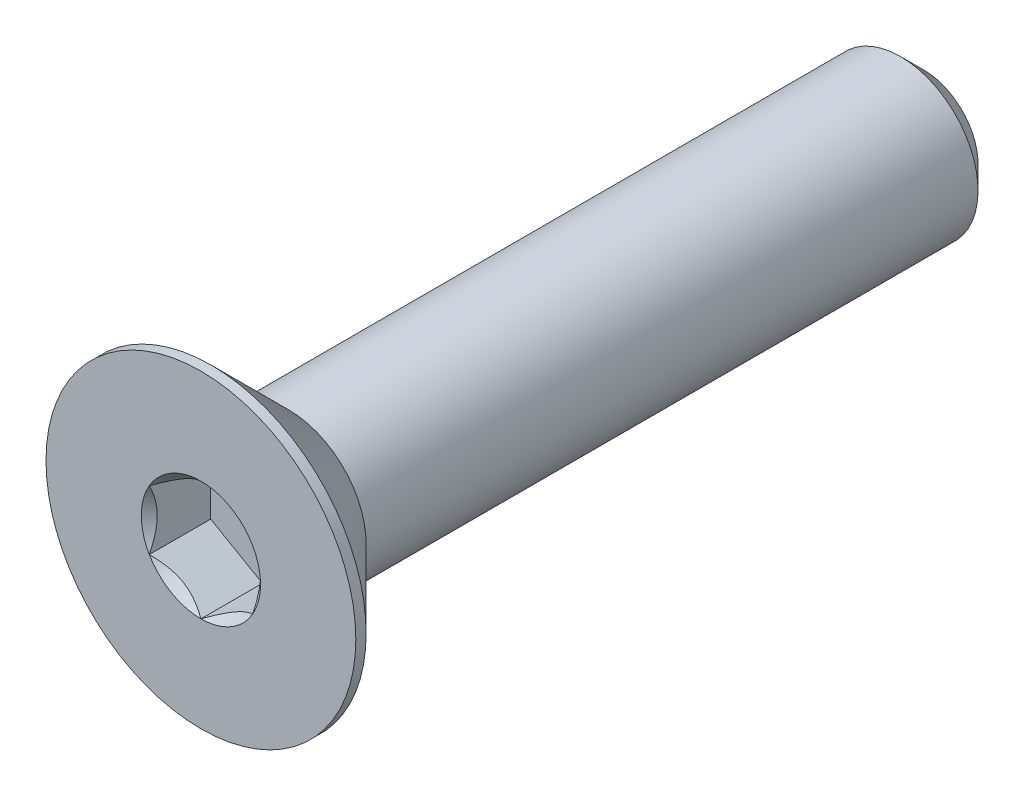
ISO-10303-21;
HEADER;
FILE_DESCRIPTION(('STEP AP214'),'2;1');
FILE_NAME('part.step','',(''),(''),'','','');
FILE_SCHEMA(('AUTOMOTIVE_DESIGN { 1 0 10303 214 1 1 1 1 }'));
ENDSEC;
DATA;
#1=APPLICATION_CONTEXT('core data for automotive mechanical design processes');
#2=APPLICATION_PROTOCOL_DEFINITION('international standard','automotive_design',2000,#1);
#3=PRODUCT_CONTEXT('',#1,'mechanical');
#4=PRODUCT('Part','Part','',(#3));
#5=PRODUCT_RELATED_PRODUCT_CATEGORY('part','',(#4));
#6=PRODUCT_DEFINITION_FORMATION('','',#4);
#7=PRODUCT_DEFINITION_CONTEXT('part definition',#1,'design');
#8=PRODUCT_DEFINITION('design','',#6,#7);
#9=PRODUCT_DEFINITION_SHAPE('','',#8);
#10=(LENGTH_UNIT() NAMED_UNIT(*) SI_UNIT(.MILLI.,.METRE.));
#11=(NAMED_UNIT(*) PLANE_ANGLE_UNIT() SI_UNIT($,.RADIAN.));
#12=(NAMED_UNIT(*) SI_UNIT($,.STERADIAN.) SOLID_ANGLE_UNIT());
#13=UNCERTAINTY_MEASURE_WITH_UNIT(LENGTH_MEASURE(1.E-05),#10,'distance_accuracy_value','');
#14=(GEOMETRIC_REPRESENTATION_CONTEXT(3) GLOBAL_UNCERTAINTY_ASSIGNED_CONTEXT((#13)) GLOBAL_UNIT_ASSIGNED_CONTEXT((#10,
#11,#12)) REPRESENTATION_CONTEXT('',''));
#15=CARTESIAN_POINT('',(0.,0.,0.));
#16=DIRECTION('',(0.,0.,1.));
#17=DIRECTION('',(1.,0.,0.));
#18=AXIS2_PLACEMENT_3D('',#15,#16,#17);
#19=CARTESIAN_POINT('',(0.,0.,-7.));
#20=DIRECTION('',(0.,0.,-1.));
#21=DIRECTION('',(0.,1.,0.));
#22=AXIS2_PLACEMENT_3D('',#19,#20,#21);
#23=CYLINDRICAL_SURFACE('',#22,1.5);
#24=CARTESIAN_POINT('',(0.,0.,5.3));
#25=DIRECTION('',(0.,0.,-1.));
#26=DIRECTION('',(0.,1.,0.));
#27=AXIS2_PLACEMENT_3D('',#24,#25,#26);
#28=CIRCLE('',#27,1.5);
#29=CARTESIAN_POINT('',(0.,1.5,5.3));
#30=VERTEX_POINT('',#29);
#31=EDGE_CURVE('E11',#30,#30,#28,.F.);
#32=ORIENTED_EDGE('',*,*,#31,.F.);
#33=EDGE_LOOP('',(#32));
#34=FACE_BOUND('',#33,.T.);
#35=CARTESIAN_POINT('',(0.,0.,-6.55));
#36=DIRECTION('',(0.,0.,-1.));
#37=DIRECTION('',(0.,1.,0.));
#38=AXIS2_PLACEMENT_3D('',#35,#36,#37);
#39=CIRCLE('',#38,1.5);
#40=CARTESIAN_POINT('',(0.,1.5,-6.55));
#41=VERTEX_POINT('',#40);
#42=EDGE_CURVE('E50',#41,#41,#39,.F.);
#43=ORIENTED_EDGE('',*,*,#42,.T.);
#44=EDGE_LOOP('',(#43));
#45=FACE_BOUND('',#44,.T.);
#46=ADVANCED_FACE('F41',(#34,#45),#23,.T.);
#47=CARTESIAN_POINT('',(0.,1.5,-7.));
#48=DIRECTION('',(0.,0.,-1.));
#49=DIRECTION('',(0.,1.,0.));
#50=AXIS2_PLACEMENT_3D('',#47,#48,#49);
#51=PLANE('',#50);
#52=CARTESIAN_POINT('',(0.,0.,-7.));
#53=DIRECTION('',(0.,0.,-1.));
#54=DIRECTION('',(0.,1.,0.));
#55=AXIS2_PLACEMENT_3D('',#52,#53,#54);
#56=CIRCLE('',#55,1.05);
#57=CARTESIAN_POINT('',(0.,1.05,-7.));
#58=VERTEX_POINT('',#57);
#59=EDGE_CURVE('E166',#58,#58,#56,.T.);
#60=ORIENTED_EDGE('',*,*,#59,.T.);
#61=EDGE_LOOP('',(#60));
#62=FACE_BOUND('',#61,.T.);
#63=ADVANCED_FACE('F177',(#62),#51,.T.);
#64=CARTESIAN_POINT('',(0.,0.,-7.));
#65=DIRECTION('',(0.,0.,1.));
#66=DIRECTION('',(0.,-1.,0.));
#67=AXIS2_PLACEMENT_3D('',#64,#65,#66);
#68=CONICAL_SURFACE('',#67,1.05,0.785398163397447);
#69=ORIENTED_EDGE('',*,*,#42,.F.);
#70=EDGE_LOOP('',(#69));
#71=FACE_BOUND('',#70,.T.);
#72=ORIENTED_EDGE('',*,*,#59,.F.);
#73=EDGE_LOOP('',(#72));
#74=FACE_BOUND('',#73,.T.);
#75=ADVANCED_FACE('F43',(#71,#74),#68,.T.);
#76=CARTESIAN_POINT('',(0.,0.,-7.));
#77=DIRECTION('',(0.,0.,-1.));
#78=DIRECTION('',(0.,1.,0.));
#79=AXIS2_PLACEMENT_3D('',#76,#77,#78);
#80=CYLINDRICAL_SURFACE('',#79,3.);
#81=CARTESIAN_POINT('',(0.,0.,7.));
#82=DIRECTION('',(0.,0.,-1.));
#83=DIRECTION('',(0.,1.,0.));
#84=AXIS2_PLACEMENT_3D('',#81,#82,#83);
#85=CIRCLE('',#84,3.);
#86=CARTESIAN_POINT('',(0.,3.,7.));
#87=VERTEX_POINT('',#86);
#88=EDGE_CURVE('E141',#87,#87,#85,.T.);
#89=ORIENTED_EDGE('',*,*,#88,.T.);
#90=EDGE_LOOP('',(#89));
#91=FACE_BOUND('',#90,.T.);
#92=CARTESIAN_POINT('',(0.,0.,6.8));
#93=DIRECTION('',(0.,0.,-1.));
#94=DIRECTION('',(0.,1.,0.));
#95=AXIS2_PLACEMENT_3D('',#92,#93,#94);
#96=CIRCLE('',#95,3.);
#97=CARTESIAN_POINT('',(0.,3.,6.8));
#98=VERTEX_POINT('',#97);
#99=EDGE_CURVE('E136',#98,#98,#96,.T.);
#100=ORIENTED_EDGE('',*,*,#99,.F.);
#101=EDGE_LOOP('',(#100));
#102=FACE_BOUND('',#101,.T.);
#103=ADVANCED_FACE('F176',(#91,#102),#80,.T.);
#104=CARTESIAN_POINT('',(0.,0.,5.3));
#105=DIRECTION('',(0.,0.,1.));
#106=DIRECTION('',(0.,-1.,0.));
#107=AXIS2_PLACEMENT_3D('',#104,#105,#106);
#108=CONICAL_SURFACE('',#107,1.5,0.785398163397449);
#109=ORIENTED_EDGE('',*,*,#99,.T.);
#110=EDGE_LOOP('',(#109));
#111=FACE_BOUND('',#110,.T.);
#112=ORIENTED_EDGE('',*,*,#31,.T.);
#113=EDGE_LOOP('',(#112));
#114=FACE_BOUND('',#113,.T.);
#115=ADVANCED_FACE('F190',(#111,#114),#108,.T.);
#116=CARTESIAN_POINT('',(0.,0.,7.));
#117=DIRECTION('',(0.,0.,1.));
#118=DIRECTION('',(0.,-1.,0.));
#119=AXIS2_PLACEMENT_3D('',#116,#117,#118);
#120=PLANE('',#119);
#121=CARTESIAN_POINT('',(0.,0.,7.));
#122=DIRECTION('',(0.,0.,1.));
#123=DIRECTION('',(1.,0.,0.));
#124=AXIS2_PLACEMENT_3D('',#121,#122,#123);
#125=CIRCLE('',#124,1.15470053837925);
#126=CARTESIAN_POINT('',(1.,0.577350269189633,7.));
#127=VERTEX_POINT('',#126);
#128=CARTESIAN_POINT('',(0.,1.15470053837926,7.));
#129=VERTEX_POINT('',#128);
#130=EDGE_CURVE('E101',#127,#129,#125,.T.);
#131=ORIENTED_EDGE('',*,*,#130,.F.);
#132=CARTESIAN_POINT('',(0.,0.,7.));
#133=DIRECTION('',(0.,0.,1.));
#134=DIRECTION('',(1.,0.,0.));
#135=AXIS2_PLACEMENT_3D('',#132,#133,#134);
#136=CIRCLE('',#135,1.15470053837925);
#137=CARTESIAN_POINT('',(0.999999999999991,-0.577350269189631,7.));
#138=VERTEX_POINT('',#137);
#139=EDGE_CURVE('E114',#138,#127,#136,.T.);
#140=ORIENTED_EDGE('',*,*,#139,.F.);
#141=CARTESIAN_POINT('',(0.,0.,7.));
#142=DIRECTION('',(0.,0.,1.));
#143=DIRECTION('',(1.,0.,0.));
#144=AXIS2_PLACEMENT_3D('',#141,#142,#143);
#145=CIRCLE('',#144,1.15470053837925);
#146=CARTESIAN_POINT('',(0.,-1.15470053837924,7.));
#147=VERTEX_POINT('',#146);
#148=EDGE_CURVE('E270',#147,#138,#145,.T.);
#149=ORIENTED_EDGE('',*,*,#148,.F.);
#150=CARTESIAN_POINT('',(0.,0.,7.));
#151=DIRECTION('',(0.,0.,1.));
#152=DIRECTION('',(1.,0.,0.));
#153=AXIS2_PLACEMENT_3D('',#150,#151,#152);
#154=CIRCLE('',#153,1.15470053837925);
#155=CARTESIAN_POINT('',(-1.,-0.577350269189616,7.));
#156=VERTEX_POINT('',#155);
#157=EDGE_CURVE('E130',#156,#147,#154,.T.);
#158=ORIENTED_EDGE('',*,*,#157,.F.);
#159=CARTESIAN_POINT('',(0.,0.,7.));
#160=DIRECTION('',(0.,0.,1.));
#161=DIRECTION('',(1.,0.,0.));
#162=AXIS2_PLACEMENT_3D('',#159,#160,#161);
#163=CIRCLE('',#162,1.15470053837925);
#164=CARTESIAN_POINT('',(-1.00000000000001,0.577350269189623,7.));
#165=VERTEX_POINT('',#164);
#166=EDGE_CURVE('E271',#165,#156,#163,.T.);
#167=ORIENTED_EDGE('',*,*,#166,.F.);
#168=CARTESIAN_POINT('',(0.,0.,7.));
#169=DIRECTION('',(0.,0.,1.));
#170=DIRECTION('',(1.,0.,0.));
#171=AXIS2_PLACEMENT_3D('',#168,#169,#170);
#172=CIRCLE('',#171,1.15470053837925);
#173=EDGE_CURVE('E117',#129,#165,#172,.T.);
#174=ORIENTED_EDGE('',*,*,#173,.F.);
#175=EDGE_LOOP('',(#131,#140,#149,#158,#167,#174));
#176=FACE_BOUND('',#175,.T.);
#177=ORIENTED_EDGE('',*,*,#88,.F.);
#178=EDGE_LOOP('',(#177));
#179=FACE_BOUND('',#178,.T.);
#180=ADVANCED_FACE('F111',(#176,#179),#120,.T.);
#181=CARTESIAN_POINT('',(1.,0.577350269189626,5.81));
#182=DIRECTION('',(0.5,0.866025403784438,0.));
#183=DIRECTION('',(-0.866025403784439,0.5,0.));
#184=AXIS2_PLACEMENT_3D('',#181,#182,#183);
#185=PLANE('',#184);
#186=DIRECTION('',(0.,0.,1.));
#187=VECTOR('',#186,1.);
#188=CARTESIAN_POINT('',(1.,0.577350269189626,5.81));
#189=LINE('',#188,#187);
#190=CARTESIAN_POINT('',(1.,0.577350269189626,5.81));
#191=VERTEX_POINT('',#190);
#192=EDGE_CURVE('E57',#191,#127,#189,.T.);
#193=ORIENTED_EDGE('',*,*,#192,.T.);
#194=CARTESIAN_POINT('',(-0.00019999999999976,1.15481600843309,7.00011548737261));
#195=CARTESIAN_POINT('',(0.0341825950071804,1.13496520795026,6.98027793082573));
#196=CARTESIAN_POINT('',(0.0691401181398243,1.11478247255942,6.96160502063888));
#197=CARTESIAN_POINT('',(0.140422802956089,1.07362739529219,6.92741474272315));
#198=CARTESIAN_POINT('',(0.176754750528983,1.0526511355808,6.91191640902345));
#199=CARTESIAN_POINT('',(0.25001661380331,1.01035337909803,6.88536730714226));
#200=CARTESIAN_POINT('',(0.286927851445413,0.989042666109242,6.87424977399692));
#201=CARTESIAN_POINT('',(0.361562729310857,0.945952199282693,6.85711986577618));
#202=CARTESIAN_POINT('',(0.399284088108634,0.924173762626598,6.85109469746667));
#203=CARTESIAN_POINT('',(0.464292198417931,0.886641312640016,6.84566055496749));
#204=CARTESIAN_POINT('',(0.491494371528169,0.870936130672277,6.84485693831673));
#205=CARTESIAN_POINT('',(0.545846040669109,0.83955617986285,6.84620669941688));
#206=CARTESIAN_POINT('',(0.572995523754872,0.823881418494926,6.84836072954719));
#207=CARTESIAN_POINT('',(0.654056277326956,0.777080970599369,6.85911697212847));
#208=CARTESIAN_POINT('',(0.707564140978423,0.746188191116433,6.87201455641535));
#209=CARTESIAN_POINT('',(0.801476065143428,0.691968116419652,6.90314073060217));
#210=CARTESIAN_POINT('',(0.842320523671831,0.668386557293373,6.91973779770183));
#211=CARTESIAN_POINT('',(0.922409637381942,0.622147085933683,6.95712492468529));
#212=CARTESIAN_POINT('',(0.961659010870436,0.599486449584576,6.9779013418174));
#213=CARTESIAN_POINT('',(1.0002,0.577234799135788,7.00011548737261));
#214=B_SPLINE_CURVE_WITH_KNOTS('',3,(#194,#195,#196,#197,#198,#199,#200,#201,#202,#203,#204,
#205,#206,#207,#208,#209,#210,#211,#212,#213),.UNSPECIFIED.,.F.,.F.,(4,2,2,2,2,2,2,2,2,4),(0.,
0.133237676828558,0.267252229834488,0.399137076269297,0.530689603280765,0.624814864263842,
0.718960890149128,0.907306626112092,1.05710100361789,1.20641411519286),.UNSPECIFIED.);
#215=EDGE_CURVE('E98',#129,#127,#214,.T.);
#216=ORIENTED_EDGE('',*,*,#215,.F.);
#217=DIRECTION('',(0.,0.,1.));
#218=VECTOR('',#217,1.);
#219=CARTESIAN_POINT('',(0.,1.15470053837925,5.81));
#220=LINE('',#219,#218);
#221=CARTESIAN_POINT('',(0.,1.15470053837925,5.81));
#222=VERTEX_POINT('',#221);
#223=EDGE_CURVE('E160',#222,#129,#220,.T.);
#224=ORIENTED_EDGE('',*,*,#223,.F.);
#225=DIRECTION('',(-0.866025403784439,0.5,0.));
#226=VECTOR('',#225,1.);
#227=CARTESIAN_POINT('',(1.,0.577350269189626,5.81));
#228=LINE('',#227,#226);
#229=EDGE_CURVE('E126',#191,#222,#228,.T.);
#230=ORIENTED_EDGE('',*,*,#229,.F.);
#231=EDGE_LOOP('',(#193,#216,#224,#230));
#232=FACE_BOUND('',#231,.T.);
#233=ADVANCED_FACE('F132',(#232),#185,.F.);
#234=CARTESIAN_POINT('',(1.,-0.577350269189626,5.81));
#235=DIRECTION('',(1.,0.,0.));
#236=DIRECTION('',(0.,1.,0.));
#237=AXIS2_PLACEMENT_3D('',#234,#235,#236);
#238=PLANE('',#237);
#239=DIRECTION('',(0.,0.,1.));
#240=VECTOR('',#239,1.);
#241=CARTESIAN_POINT('',(1.,-0.577350269189626,5.81));
#242=LINE('',#241,#240);
#243=CARTESIAN_POINT('',(1.,-0.577350269189626,5.81));
#244=VERTEX_POINT('',#243);
#245=EDGE_CURVE('E65',#244,#138,#242,.T.);
#246=ORIENTED_EDGE('',*,*,#245,.T.);
#247=CARTESIAN_POINT('',(1.,-1.15147208646462,7.37038567751387));
#248=CARTESIAN_POINT('',(1.,-1.12343447988552,7.34921991987372));
#249=CARTESIAN_POINT('',(1.,-1.09524064850698,7.32826169217592));
#250=CARTESIAN_POINT('',(1.,-1.03847715644377,7.28684602223563));
#251=CARTESIAN_POINT('',(1.,-1.00990740382975,7.26638870612367));
#252=CARTESIAN_POINT('',(1.,-0.92312089433348,7.20560479495452));
#253=CARTESIAN_POINT('',(1.,-0.864253173759062,7.16619222896141));
#254=CARTESIAN_POINT('',(1.,-0.740809858258047,7.08882066420021));
#255=CARTESIAN_POINT('',(1.,-0.676100255137808,7.05107303911435));
#256=CARTESIAN_POINT('',(1.,-0.543448939049124,6.9820245875513));
#257=CARTESIAN_POINT('',(1.,-0.475519112027777,6.95070202784687));
#258=CARTESIAN_POINT('',(1.,-0.373555850333526,6.9123817788838));
#259=CARTESIAN_POINT('',(1.,-0.341031989670905,6.90138359164216));
#260=CARTESIAN_POINT('',(1.,-0.27519907905229,6.88199834214736));
#261=CARTESIAN_POINT('',(1.,-0.241889975173929,6.8736114597767));
#262=CARTESIAN_POINT('',(1.,-0.175247517042989,6.86002522071902));
#263=CARTESIAN_POINT('',(1.,-0.141925568218171,6.85477079076797));
#264=CARTESIAN_POINT('',(1.,-0.0749144362322744,6.84754868657089));
#265=CARTESIAN_POINT('',(1.,-0.0412251978501569,6.84558151361051));
#266=CARTESIAN_POINT('',(1.,0.0249580992634263,6.84508319839316));
#267=CARTESIAN_POINT('',(1.,0.0574512826460448,6.84643026788863));
#268=CARTESIAN_POINT('',(1.,0.122148505701873,6.85221648449898));
#269=CARTESIAN_POINT('',(1.,0.154352610132933,6.85665492066154));
#270=CARTESIAN_POINT('',(1.,0.218799898867646,6.8684568301452));
#271=CARTESIAN_POINT('',(1.,0.25103374326896,6.87587054103851));
#272=CARTESIAN_POINT('',(1.,0.314797132354926,6.89322894249868));
#273=CARTESIAN_POINT('',(1.,0.346326735731012,6.90317342128883));
#274=CARTESIAN_POINT('',(1.,0.445594187730212,6.93822348255434));
#275=CARTESIAN_POINT('',(1.,0.511919139476043,6.96732085835672));
#276=CARTESIAN_POINT('',(1.,0.641453244657538,7.0320153296865));
#277=CARTESIAN_POINT('',(1.,0.704650133126351,7.06763577671524));
#278=CARTESIAN_POINT('',(1.,0.825428490174992,7.14112390134693));
#279=CARTESIAN_POINT('',(1.,0.88313294786769,7.17879194713546));
#280=CARTESIAN_POINT('',(1.,0.968148853704571,7.23702285294316));
#281=CARTESIAN_POINT('',(1.,0.99612057038029,7.25663847576285));
#282=CARTESIAN_POINT('',(1.,1.05168177729902,7.29638851706127));
#283=CARTESIAN_POINT('',(1.,1.07927136997701,7.31652279219883));
#284=CARTESIAN_POINT('',(1.,1.1067018534633,7.33687211907297));
#285=B_SPLINE_CURVE_WITH_KNOTS('',3,(#247,#248,#249,#250,#251,#252,#253,#254,#255,#256,#257,
#258,#259,#260,#261,#262,#263,#264,#265,#266,#267,#268,#269,#270,#271,#272,#273,#274,#275,#276,
#277,#278,#279,#280,#281,#282,#283,#284),.UNSPECIFIED.,.F.,.F.,(4,2,2,2,2,2,2,2,2,2,2,2,2,2,2,2,
2,2,4),(0.,0.105386459083292,0.210799187330127,0.423233611565475,0.647793540908512,
0.871580877738622,0.974493074181434,1.07741235827203,1.17846428203206,1.27953161415764,
1.37694086739612,1.47432772585409,1.57343322804295,1.67253043972853,1.88917353996829,
2.10660791038814,2.31323734249845,2.41572589232046,2.51818641476505),.UNSPECIFIED.);
#286=EDGE_CURVE('E124',#127,#138,#285,.F.);
#287=ORIENTED_EDGE('',*,*,#286,.F.);
#288=ORIENTED_EDGE('',*,*,#192,.F.);
#289=DIRECTION('',(0.,1.,0.));
#290=VECTOR('',#289,1.);
#291=CARTESIAN_POINT('',(1.,-0.577350269189626,5.81));
#292=LINE('',#291,#290);
#293=EDGE_CURVE('E146',#244,#191,#292,.T.);
#294=ORIENTED_EDGE('',*,*,#293,.F.);
#295=EDGE_LOOP('',(#246,#287,#288,#294));
#296=FACE_BOUND('',#295,.T.);
#297=ADVANCED_FACE('F128',(#296),#238,.F.);
#298=CARTESIAN_POINT('',(0.,-1.15470053837925,5.81));
#299=DIRECTION('',(0.5,-0.866025403784439,0.));
#300=DIRECTION('',(0.866025403784439,0.5,0.));
#301=AXIS2_PLACEMENT_3D('',#298,#299,#300);
#302=PLANE('',#301);
#303=DIRECTION('',(0.,0.,1.));
#304=VECTOR('',#303,1.);
#305=CARTESIAN_POINT('',(0.,-1.15470053837925,5.81));
#306=LINE('',#305,#304);
#307=CARTESIAN_POINT('',(0.,-1.15470053837925,5.81));
#308=VERTEX_POINT('',#307);
#309=EDGE_CURVE('E143',#308,#147,#306,.T.);
#310=ORIENTED_EDGE('',*,*,#309,.T.);
#311=CARTESIAN_POINT('',(1.0002,-0.577234799135788,7.00011548737262));
#312=CARTESIAN_POINT('',(0.96581740499282,-0.597085599618621,6.98027793082574));
#313=CARTESIAN_POINT('',(0.930859881860176,-0.617268335009456,6.96160502063889));
#314=CARTESIAN_POINT('',(0.859577197043911,-0.658423412276685,6.92741474272316));
#315=CARTESIAN_POINT('',(0.823245249471017,-0.679399671988079,6.91191640902347));
#316=CARTESIAN_POINT('',(0.74998338619669,-0.721697428470845,6.88536730714227));
#317=CARTESIAN_POINT('',(0.713072148554587,-0.743008141459636,6.87424977399693));
#318=CARTESIAN_POINT('',(0.638437270689143,-0.786098608286185,6.85711986577619));
#319=CARTESIAN_POINT('',(0.600715911891367,-0.807877044942279,6.85109469746668));
#320=CARTESIAN_POINT('',(0.535707801582069,-0.845409494928861,6.8456605549675));
#321=CARTESIAN_POINT('',(0.50850562847183,-0.8611146768966,6.84485693831674));
#322=CARTESIAN_POINT('',(0.45415395933089,-0.892494627706027,6.84620669941689));
#323=CARTESIAN_POINT('',(0.427004476245126,-0.908169389073953,6.84836072954721));
#324=CARTESIAN_POINT('',(0.345943722673041,-0.95496983696951,6.85911697212848));
#325=CARTESIAN_POINT('',(0.292435859021573,-0.985862616452446,6.87201455641536));
#326=CARTESIAN_POINT('',(0.198523934856569,-1.04008269114923,6.90314073060219));
#327=CARTESIAN_POINT('',(0.157679476328166,-1.06366425027551,6.91973779770185));
#328=CARTESIAN_POINT('',(0.0775903626180566,-1.1099037216352,6.9571249246853));
#329=CARTESIAN_POINT('',(0.0383409891295624,-1.1325643579843,6.97790134181741));
#330=CARTESIAN_POINT('',(-0.0001999999999999,-1.15481600843309,7.00011548737262));
#331=B_SPLINE_CURVE_WITH_KNOTS('',3,(#311,#312,#313,#314,#315,#316,#317,#318,#319,#320,#321,
#322,#323,#324,#325,#326,#327,#328,#329,#330),.UNSPECIFIED.,.F.,.F.,(4,2,2,2,2,2,2,2,2,4),(0.,
0.133237676828558,0.267252229834488,0.399137076269297,0.530689603280764,0.624814864263843,
0.71896089014913,0.907306626112096,1.05710100361789,1.20641411519286),.UNSPECIFIED.);
#332=EDGE_CURVE('E267',#138,#147,#331,.T.);
#333=ORIENTED_EDGE('',*,*,#332,.F.);
#334=ORIENTED_EDGE('',*,*,#245,.F.);
#335=DIRECTION('',(0.866025403784439,0.5,0.));
#336=VECTOR('',#335,1.);
#337=CARTESIAN_POINT('',(0.,-1.15470053837925,5.81));
#338=LINE('',#337,#336);
#339=EDGE_CURVE('E257',#308,#244,#338,.T.);
#340=ORIENTED_EDGE('',*,*,#339,.F.);
#341=EDGE_LOOP('',(#310,#333,#334,#340));
#342=FACE_BOUND('',#341,.T.);
#343=ADVANCED_FACE('F216',(#342),#302,.F.);
#344=CARTESIAN_POINT('',(-1.,-0.577350269189626,5.81));
#345=DIRECTION('',(-0.5,-0.866025403784439,0.));
#346=DIRECTION('',(0.866025403784439,-0.5,0.));
#347=AXIS2_PLACEMENT_3D('',#344,#345,#346);
#348=PLANE('',#347);
#349=DIRECTION('',(0.,0.,1.));
#350=VECTOR('',#349,1.);
#351=CARTESIAN_POINT('',(-1.,-0.577350269189626,5.81));
#352=LINE('',#351,#350);
#353=CARTESIAN_POINT('',(-1.,-0.577350269189626,5.81));
#354=VERTEX_POINT('',#353);
#355=EDGE_CURVE('E152',#354,#156,#352,.T.);
#356=ORIENTED_EDGE('',*,*,#355,.T.);
#357=CARTESIAN_POINT('',(0.000199999999999741,-1.15481600843309,7.00011548737262));
#358=CARTESIAN_POINT('',(-0.0341825950071811,-1.13496520795026,6.98027793082574));
#359=CARTESIAN_POINT('',(-0.0691401181398254,-1.11478247255942,6.9616050206389));
#360=CARTESIAN_POINT('',(-0.140422802956091,-1.07362739529219,6.92741474272317));
#361=CARTESIAN_POINT('',(-0.176754750528985,-1.0526511355808,6.91191640902347));
#362=CARTESIAN_POINT('',(-0.250016613803313,-1.01035337909803,6.88536730714227));
#363=CARTESIAN_POINT('',(-0.286927851445416,-0.989042666109239,6.87424977399693));
#364=CARTESIAN_POINT('',(-0.361562729310862,-0.945952199282689,6.85711986577619));
#365=CARTESIAN_POINT('',(-0.399284088108639,-0.924173762626594,6.85109469746668));
#366=CARTESIAN_POINT('',(-0.464292198417937,-0.886641312640012,6.8456605549675));
#367=CARTESIAN_POINT('',(-0.491494371528175,-0.870936130672273,6.84485693831674));
#368=CARTESIAN_POINT('',(-0.545846040669116,-0.839556179862846,6.8462066994169));
#369=CARTESIAN_POINT('',(-0.57299552375488,-0.823881418494921,6.84836072954721));
#370=CARTESIAN_POINT('',(-0.654056277326965,-0.777080970599364,6.85911697212848));
#371=CARTESIAN_POINT('',(-0.707564140978432,-0.746188191116427,6.87201455641536));
#372=CARTESIAN_POINT('',(-0.801476065143436,-0.691968116419647,6.90314073060219));
#373=CARTESIAN_POINT('',(-0.842320523671838,-0.668386557293369,6.91973779770185));
#374=CARTESIAN_POINT('',(-0.922409637381945,-0.62214708593368,6.9571249246853));
#375=CARTESIAN_POINT('',(-0.961659010870439,-0.599486449584574,6.97790134181741));
#376=CARTESIAN_POINT('',(-1.0002,-0.577234799135788,7.00011548737262));
#377=B_SPLINE_CURVE_WITH_KNOTS('',3,(#357,#358,#359,#360,#361,#362,#363,#364,#365,#366,#367,
#368,#369,#370,#371,#372,#373,#374,#375,#376),.UNSPECIFIED.,.F.,.F.,(4,2,2,2,2,2,2,2,2,4),(0.,
0.13323767682856,0.267252229834492,0.399137076269303,0.530689603280771,0.62481486426385,
0.718960890149138,0.907306626112103,1.0571010036179,1.20641411519286),.UNSPECIFIED.);
#378=EDGE_CURVE('E233',#147,#156,#377,.T.);
#379=ORIENTED_EDGE('',*,*,#378,.F.);
#380=ORIENTED_EDGE('',*,*,#309,.F.);
#381=DIRECTION('',(0.866025403784438,-0.5,0.));
#382=VECTOR('',#381,1.);
#383=CARTESIAN_POINT('',(-1.,-0.577350269189626,5.81));
#384=LINE('',#383,#382);
#385=EDGE_CURVE('E254',#354,#308,#384,.T.);
#386=ORIENTED_EDGE('',*,*,#385,.F.);
#387=EDGE_LOOP('',(#356,#379,#380,#386));
#388=FACE_BOUND('',#387,.T.);
#389=ADVANCED_FACE('F212',(#388),#348,.F.);
#390=CARTESIAN_POINT('',(-1.,0.577350269189626,5.81));
#391=DIRECTION('',(-1.,0.,0.));
#392=DIRECTION('',(0.,0.,1.));
#393=AXIS2_PLACEMENT_3D('',#390,#391,#392);
#394=PLANE('',#393);
#395=DIRECTION('',(0.,0.,1.));
#396=VECTOR('',#395,1.);
#397=CARTESIAN_POINT('',(-1.,0.577350269189626,5.81));
#398=LINE('',#397,#396);
#399=CARTESIAN_POINT('',(-1.,0.577350269189626,5.81));
#400=VERTEX_POINT('',#399);
#401=EDGE_CURVE('E156',#400,#165,#398,.T.);
#402=ORIENTED_EDGE('',*,*,#401,.T.);
#403=CARTESIAN_POINT('',(-1.,-1.15147208646462,7.37038567751387));
#404=CARTESIAN_POINT('',(-1.,-1.12343447988553,7.34921991987372));
#405=CARTESIAN_POINT('',(-1.,-1.09524064850698,7.32826169217592));
#406=CARTESIAN_POINT('',(-1.,-1.03847715644377,7.28684602223563));
#407=CARTESIAN_POINT('',(-1.,-1.00990740382975,7.26638870612367));
#408=CARTESIAN_POINT('',(-1.,-0.923120894333481,7.20560479495452));
#409=CARTESIAN_POINT('',(-1.,-0.864253173759063,7.16619222896141));
#410=CARTESIAN_POINT('',(-1.,-0.740809858258047,7.08882066420021));
#411=CARTESIAN_POINT('',(-1.,-0.676100255137808,7.05107303911435));
#412=CARTESIAN_POINT('',(-1.,-0.543448939049124,6.9820245875513));
#413=CARTESIAN_POINT('',(-1.,-0.475519112027778,6.95070202784687));
#414=CARTESIAN_POINT('',(-1.,-0.373555850333526,6.9123817788838));
#415=CARTESIAN_POINT('',(-1.,-0.341031989670905,6.90138359164216));
#416=CARTESIAN_POINT('',(-1.,-0.27519907905229,6.88199834214736));
#417=CARTESIAN_POINT('',(-1.,-0.241889975173929,6.8736114597767));
#418=CARTESIAN_POINT('',(-1.,-0.175247517042989,6.86002522071902));
#419=CARTESIAN_POINT('',(-1.,-0.141925568218171,6.85477079076797));
#420=CARTESIAN_POINT('',(-1.,-0.0749144362322744,6.84754868657089));
#421=CARTESIAN_POINT('',(-1.,-0.041225197850157,6.84558151361051));
#422=CARTESIAN_POINT('',(-1.,0.0249580992634262,6.84508319839316));
#423=CARTESIAN_POINT('',(-1.,0.0574512826460446,6.84643026788863));
#424=CARTESIAN_POINT('',(-1.,0.122148505701872,6.85221648449898));
#425=CARTESIAN_POINT('',(-1.,0.154352610132932,6.85665492066154));
#426=CARTESIAN_POINT('',(-1.,0.218799898867646,6.8684568301452));
#427=CARTESIAN_POINT('',(-1.,0.25103374326896,6.87587054103851));
#428=CARTESIAN_POINT('',(-1.,0.314797132354926,6.89322894249868));
#429=CARTESIAN_POINT('',(-1.,0.346326735731011,6.90317342128883));
#430=CARTESIAN_POINT('',(-1.,0.445594187730212,6.93822348255434));
#431=CARTESIAN_POINT('',(-1.,0.511919139476043,6.96732085835672));
#432=CARTESIAN_POINT('',(-1.,0.641453244657539,7.0320153296865));
#433=CARTESIAN_POINT('',(-1.,0.704650133126351,7.06763577671524));
#434=CARTESIAN_POINT('',(-1.,0.825428490174993,7.14112390134693));
#435=CARTESIAN_POINT('',(-1.,0.883132947867691,7.17879194713546));
#436=CARTESIAN_POINT('',(-1.,0.968148853704571,7.23702285294316));
#437=CARTESIAN_POINT('',(-1.,0.996120570380291,7.25663847576286));
#438=CARTESIAN_POINT('',(-1.,1.05168177729902,7.29638851706127));
#439=CARTESIAN_POINT('',(-1.,1.07927136997701,7.31652279219883));
#440=CARTESIAN_POINT('',(-1.,1.1067018534633,7.33687211907297));
#441=B_SPLINE_CURVE_WITH_KNOTS('',3,(#403,#404,#405,#406,#407,#408,#409,#410,#411,#412,#413,
#414,#415,#416,#417,#418,#419,#420,#421,#422,#423,#424,#425,#426,#427,#428,#429,#430,#431,#432,
#433,#434,#435,#436,#437,#438,#439,#440),.UNSPECIFIED.,.F.,.F.,(4,2,2,2,2,2,2,2,2,2,2,2,2,2,2,2,
2,2,4),(0.,0.105386459083292,0.210799187330127,0.423233611565474,0.647793540908512,
0.871580877738622,0.974493074181434,1.07741235827203,1.17846428203206,1.27953161415764,
1.37694086739612,1.47432772585409,1.57343322804295,1.67253043972853,1.88917353996829,
2.10660791038815,2.31323734249845,2.41572589232046,2.51818641476505),.UNSPECIFIED.);
#442=EDGE_CURVE('E105',#156,#165,#441,.T.);
#443=ORIENTED_EDGE('',*,*,#442,.F.);
#444=ORIENTED_EDGE('',*,*,#355,.F.);
#445=DIRECTION('',(0.,-1.,0.));
#446=VECTOR('',#445,1.);
#447=CARTESIAN_POINT('',(-1.,0.577350269189626,5.81));
#448=LINE('',#447,#446);
#449=EDGE_CURVE('E250',#400,#354,#448,.T.);
#450=ORIENTED_EDGE('',*,*,#449,.F.);
#451=EDGE_LOOP('',(#402,#443,#444,#450));
#452=FACE_BOUND('',#451,.T.);
#453=ADVANCED_FACE('F208',(#452),#394,.F.);
#454=CARTESIAN_POINT('',(0.,1.15470053837925,5.81));
#455=DIRECTION('',(-0.5,0.866025403784439,0.));
#456=DIRECTION('',(-0.866025403784439,-0.5,0.));
#457=AXIS2_PLACEMENT_3D('',#454,#455,#456);
#458=PLANE('',#457);
#459=ORIENTED_EDGE('',*,*,#223,.T.);
#460=CARTESIAN_POINT('',(-1.0002,0.577234799135788,7.00011548737261));
#461=CARTESIAN_POINT('',(-0.965817404992819,0.597085599618622,6.98027793082573));
#462=CARTESIAN_POINT('',(-0.930859881860174,0.617268335009457,6.96160502063889));
#463=CARTESIAN_POINT('',(-0.859577197043909,0.658423412276687,6.92741474272315));
#464=CARTESIAN_POINT('',(-0.823245249471014,0.679399671988081,6.91191640902345));
#465=CARTESIAN_POINT('',(-0.749983386196687,0.721697428470848,6.88536730714226));
#466=CARTESIAN_POINT('',(-0.713072148554583,0.743008141459638,6.87424977399692));
#467=CARTESIAN_POINT('',(-0.638437270689137,0.786098608286188,6.85711986577618));
#468=CARTESIAN_POINT('',(-0.60071591189136,0.807877044942283,6.85109469746667));
#469=CARTESIAN_POINT('',(-0.535707801582062,0.845409494928865,6.84566055496749));
#470=CARTESIAN_POINT('',(-0.508505628471824,0.861114676896604,6.84485693831673));
#471=CARTESIAN_POINT('',(-0.454153959330884,0.892494627706031,6.84620669941688));
#472=CARTESIAN_POINT('',(-0.427004476245121,0.908169389073956,6.84836072954719));
#473=CARTESIAN_POINT('',(-0.345943722673037,0.954969836969513,6.85911697212847));
#474=CARTESIAN_POINT('',(-0.29243585902157,0.985862616452449,6.87201455641535));
#475=CARTESIAN_POINT('',(-0.198523934856566,1.04008269114923,6.90314073060217));
#476=CARTESIAN_POINT('',(-0.157679476328164,1.06366425027551,6.91973779770183));
#477=CARTESIAN_POINT('',(-0.0775903626180554,1.1099037216352,6.95712492468529));
#478=CARTESIAN_POINT('',(-0.0383409891295618,1.1325643579843,6.9779013418174));
#479=CARTESIAN_POINT('',(0.000200000000000301,1.15481600843309,7.00011548737261));
#480=B_SPLINE_CURVE_WITH_KNOTS('',3,(#460,#461,#462,#463,#464,#465,#466,#467,#468,#469,#470,
#471,#472,#473,#474,#475,#476,#477,#478,#479),.UNSPECIFIED.,.F.,.F.,(4,2,2,2,2,2,2,2,2,4),(0.,
0.133237676828561,0.267252229834493,0.399137076269304,0.530689603280774,0.624814864263851,
0.718960890149138,0.907306626112101,1.0571010036179,1.20641411519286),.UNSPECIFIED.);
#481=EDGE_CURVE('E263',#165,#129,#480,.T.);
#482=ORIENTED_EDGE('',*,*,#481,.F.);
#483=ORIENTED_EDGE('',*,*,#401,.F.);
#484=DIRECTION('',(-0.866025403784439,-0.5,0.));
#485=VECTOR('',#484,1.);
#486=CARTESIAN_POINT('',(0.,1.15470053837925,5.81));
#487=LINE('',#486,#485);
#488=EDGE_CURVE('E246',#222,#400,#487,.T.);
#489=ORIENTED_EDGE('',*,*,#488,.F.);
#490=EDGE_LOOP('',(#459,#482,#483,#489));
#491=FACE_BOUND('',#490,.T.);
#492=ADVANCED_FACE('F204',(#491),#458,.F.);
#493=CARTESIAN_POINT('',(0.,0.,5.81));
#494=DIRECTION('',(0.,0.,1.));
#495=DIRECTION('',(1.,0.,0.));
#496=AXIS2_PLACEMENT_3D('',#493,#494,#495);
#497=PLANE('',#496);
#498=ORIENTED_EDGE('',*,*,#229,.T.);
#499=ORIENTED_EDGE('',*,*,#488,.T.);
#500=ORIENTED_EDGE('',*,*,#449,.T.);
#501=ORIENTED_EDGE('',*,*,#385,.T.);
#502=ORIENTED_EDGE('',*,*,#339,.T.);
#503=ORIENTED_EDGE('',*,*,#293,.T.);
#504=EDGE_LOOP('',(#498,#499,#500,#501,#502,#503));
#505=FACE_BOUND('',#504,.T.);
#506=ADVANCED_FACE('F207',(#505),#497,.T.);
#507=CARTESIAN_POINT('',(0.,0.,7.));
#508=DIRECTION('',(0.,0.,1.));
#509=DIRECTION('',(1.,0.,0.));
#510=AXIS2_PLACEMENT_3D('',#507,#508,#509);
#511=CONICAL_SURFACE('',#510,1.15470053837925,0.78539816339745);
#512=ORIENTED_EDGE('',*,*,#481,.T.);
#513=ORIENTED_EDGE('',*,*,#173,.T.);
#514=EDGE_LOOP('',(#512,#513));
#515=FACE_BOUND('',#514,.T.);
#516=ADVANCED_FACE('F223',(#515),#511,.F.);
#517=CARTESIAN_POINT('',(0.,0.,7.));
#518=DIRECTION('',(0.,0.,1.));
#519=DIRECTION('',(1.,0.,0.));
#520=AXIS2_PLACEMENT_3D('',#517,#518,#519);
#521=CONICAL_SURFACE('',#520,1.15470053837925,0.78539816339745);
#522=ORIENTED_EDGE('',*,*,#378,.T.);
#523=ORIENTED_EDGE('',*,*,#157,.T.);
#524=EDGE_LOOP('',(#522,#523));
#525=FACE_BOUND('',#524,.T.);
#526=ADVANCED_FACE('F225',(#525),#521,.F.);
#527=CARTESIAN_POINT('',(0.,0.,7.));
#528=DIRECTION('',(0.,0.,1.));
#529=DIRECTION('',(1.,0.,0.));
#530=AXIS2_PLACEMENT_3D('',#527,#528,#529);
#531=CONICAL_SURFACE('',#530,1.15470053837925,0.78539816339745);
#532=ORIENTED_EDGE('',*,*,#286,.T.);
#533=ORIENTED_EDGE('',*,*,#139,.T.);
#534=EDGE_LOOP('',(#532,#533));
#535=FACE_BOUND('',#534,.T.);
#536=ADVANCED_FACE('F123',(#535),#531,.F.);
#537=CARTESIAN_POINT('',(0.,0.,7.));
#538=DIRECTION('',(0.,0.,1.));
#539=DIRECTION('',(1.,0.,0.));
#540=AXIS2_PLACEMENT_3D('',#537,#538,#539);
#541=CONICAL_SURFACE('',#540,1.15470053837925,0.78539816339745);
#542=ORIENTED_EDGE('',*,*,#332,.T.);
#543=ORIENTED_EDGE('',*,*,#148,.T.);
#544=EDGE_LOOP('',(#542,#543));
#545=FACE_BOUND('',#544,.T.);
#546=ADVANCED_FACE('F285',(#545),#541,.F.);
#547=CARTESIAN_POINT('',(0.,0.,7.));
#548=DIRECTION('',(0.,0.,1.));
#549=DIRECTION('',(1.,0.,0.));
#550=AXIS2_PLACEMENT_3D('',#547,#548,#549);
#551=CONICAL_SURFACE('',#550,1.15470053837925,0.78539816339745);
#552=ORIENTED_EDGE('',*,*,#442,.T.);
#553=ORIENTED_EDGE('',*,*,#166,.T.);
#554=EDGE_LOOP('',(#552,#553));
#555=FACE_BOUND('',#554,.T.);
#556=ADVANCED_FACE('F290',(#555),#551,.F.);
#557=CARTESIAN_POINT('',(0.,0.,7.));
#558=DIRECTION('',(0.,0.,1.));
#559=DIRECTION('',(1.,0.,0.));
#560=AXIS2_PLACEMENT_3D('',#557,#558,#559);
#561=CONICAL_SURFACE('',#560,1.15470053837925,0.78539816339745);
#562=ORIENTED_EDGE('',*,*,#215,.T.);
#563=ORIENTED_EDGE('',*,*,#130,.T.);
#564=EDGE_LOOP('',(#562,#563));
#565=FACE_BOUND('',#564,.T.);
#566=ADVANCED_FACE('F100',(#565),#561,.F.);
#567=CLOSED_SHELL('',(#46,#63,#75,#103,#115,#180,#233,#297,#343,#389,#453,#492,#506,#516,#526,
#536,#546,#556,#566));
#568=MANIFOLD_SOLID_BREP('B2',#567);
#569=ADVANCED_BREP_SHAPE_REPRESENTATION('',(#18,#568),#14);
#570=SHAPE_DEFINITION_REPRESENTATION(#9,#569);
ENDSEC;
END-ISO-10303-21;
